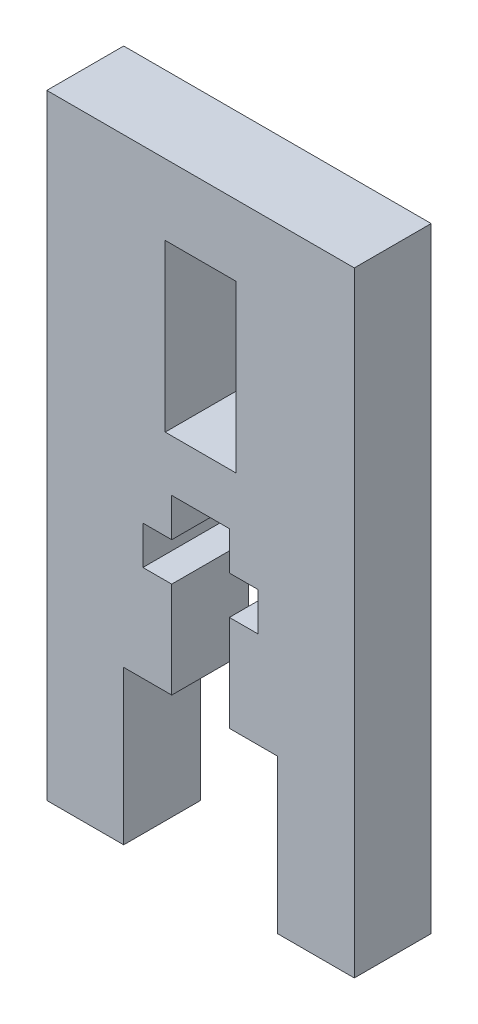
ISO-10303-21;
HEADER;
FILE_DESCRIPTION(('STEP AP214'),'2;1');
FILE_NAME('part.step','',(''),(''),'','','');
FILE_SCHEMA(('AUTOMOTIVE_DESIGN { 1 0 10303 214 1 1 1 1 }'));
ENDSEC;
DATA;
#1=APPLICATION_CONTEXT('core data for automotive mechanical design processes');
#2=APPLICATION_PROTOCOL_DEFINITION('international standard','automotive_design',2000,#1);
#3=PRODUCT_CONTEXT('',#1,'mechanical');
#4=PRODUCT('Part','Part','',(#3));
#5=PRODUCT_RELATED_PRODUCT_CATEGORY('part','',(#4));
#6=PRODUCT_DEFINITION_FORMATION('','',#4);
#7=PRODUCT_DEFINITION_CONTEXT('part definition',#1,'design');
#8=PRODUCT_DEFINITION('design','',#6,#7);
#9=PRODUCT_DEFINITION_SHAPE('','',#8);
#10=(LENGTH_UNIT() NAMED_UNIT(*) SI_UNIT(.MILLI.,.METRE.));
#11=(NAMED_UNIT(*) PLANE_ANGLE_UNIT() SI_UNIT($,.RADIAN.));
#12=(NAMED_UNIT(*) SI_UNIT($,.STERADIAN.) SOLID_ANGLE_UNIT());
#13=UNCERTAINTY_MEASURE_WITH_UNIT(LENGTH_MEASURE(1.E-05),#10,'distance_accuracy_value','');
#14=(GEOMETRIC_REPRESENTATION_CONTEXT(3) GLOBAL_UNCERTAINTY_ASSIGNED_CONTEXT((#13)) GLOBAL_UNIT_ASSIGNED_CONTEXT((#10,
#11,#12)) REPRESENTATION_CONTEXT('',''));
#15=CARTESIAN_POINT('',(0.,0.,0.));
#16=DIRECTION('',(0.,0.,1.));
#17=DIRECTION('',(1.,0.,0.));
#18=AXIS2_PLACEMENT_3D('',#15,#16,#17);
#19=CARTESIAN_POINT('',(-6.35,-12.7,6.35));
#20=DIRECTION('',(0.,1.,0.));
#21=DIRECTION('',(0.,0.,1.));
#22=AXIS2_PLACEMENT_3D('',#19,#20,#21);
#23=PLANE('',#22);
#24=DIRECTION('',(0.,0.,1.));
#25=VECTOR('',#24,1.);
#26=CARTESIAN_POINT('',(2.38125,-12.7,0.));
#27=LINE('',#26,#25);
#28=CARTESIAN_POINT('',(2.38125,-12.7,0.));
#29=VERTEX_POINT('',#28);
#30=CARTESIAN_POINT('',(2.38125,-12.7,6.35));
#31=VERTEX_POINT('',#30);
#32=EDGE_CURVE('E318',#29,#31,#27,.T.);
#33=ORIENTED_EDGE('',*,*,#32,.F.);
#34=DIRECTION('',(1.,0.,0.));
#35=VECTOR('',#34,1.);
#36=CARTESIAN_POINT('',(-6.35,-12.7,0.));
#37=LINE('',#36,#35);
#38=CARTESIAN_POINT('',(6.35,-12.7,0.));
#39=VERTEX_POINT('',#38);
#40=EDGE_CURVE('E361',#29,#39,#37,.T.);
#41=ORIENTED_EDGE('',*,*,#40,.T.);
#42=DIRECTION('',(0.,0.,-1.));
#43=VECTOR('',#42,1.);
#44=CARTESIAN_POINT('',(6.35,-12.7,6.35));
#45=LINE('',#44,#43);
#46=CARTESIAN_POINT('',(6.35,-12.7,6.35));
#47=VERTEX_POINT('',#46);
#48=EDGE_CURVE('E373',#47,#39,#45,.T.);
#49=ORIENTED_EDGE('',*,*,#48,.F.);
#50=DIRECTION('',(1.,0.,0.));
#51=VECTOR('',#50,1.);
#52=CARTESIAN_POINT('',(-6.35,-12.7,6.35));
#53=LINE('',#52,#51);
#54=EDGE_CURVE('E342',#31,#47,#53,.T.);
#55=ORIENTED_EDGE('',*,*,#54,.F.);
#56=EDGE_LOOP('',(#33,#41,#49,#55));
#57=FACE_BOUND('',#56,.T.);
#58=ADVANCED_FACE('F57',(#57),#23,.F.);
#59=CARTESIAN_POINT('',(0.,0.,6.35));
#60=DIRECTION('',(0.,0.,-1.));
#61=DIRECTION('',(-1.,0.,0.));
#62=AXIS2_PLACEMENT_3D('',#59,#60,#61);
#63=PLANE('',#62);
#64=DIRECTION('',(-1.,0.,0.));
#65=VECTOR('',#64,1.);
#66=CARTESIAN_POINT('',(-2.921,19.558,6.35));
#67=LINE('',#66,#65);
#68=CARTESIAN_POINT('',(2.921,19.558,6.35));
#69=VERTEX_POINT('',#68);
#70=CARTESIAN_POINT('',(-2.921,19.558,6.35));
#71=VERTEX_POINT('',#70);
#72=EDGE_CURVE('E245',#69,#71,#67,.T.);
#73=ORIENTED_EDGE('',*,*,#72,.F.);
#74=DIRECTION('',(0.,1.,0.));
#75=VECTOR('',#74,1.);
#76=CARTESIAN_POINT('',(2.921,19.558,6.35));
#77=LINE('',#76,#75);
#78=CARTESIAN_POINT('',(2.921,5.842,6.35));
#79=VERTEX_POINT('',#78);
#80=EDGE_CURVE('E72',#79,#69,#77,.T.);
#81=ORIENTED_EDGE('',*,*,#80,.F.);
#82=DIRECTION('',(1.,0.,0.));
#83=VECTOR('',#82,1.);
#84=CARTESIAN_POINT('',(-2.921,5.842,6.35));
#85=LINE('',#84,#83);
#86=CARTESIAN_POINT('',(-2.921,5.842,6.35));
#87=VERTEX_POINT('',#86);
#88=EDGE_CURVE('E236',#87,#79,#85,.T.);
#89=ORIENTED_EDGE('',*,*,#88,.F.);
#90=DIRECTION('',(0.,-1.,0.));
#91=VECTOR('',#90,1.);
#92=CARTESIAN_POINT('',(-2.921,19.558,6.35));
#93=LINE('',#92,#91);
#94=EDGE_CURVE('E239',#71,#87,#93,.T.);
#95=ORIENTED_EDGE('',*,*,#94,.F.);
#96=EDGE_LOOP('',(#73,#81,#89,#95));
#97=FACE_BOUND('',#96,.T.);
#98=DIRECTION('',(0.,-1.,0.));
#99=VECTOR('',#98,1.);
#100=CARTESIAN_POINT('',(2.38125,1.5875,6.35));
#101=LINE('',#100,#99);
#102=CARTESIAN_POINT('',(2.38125,-4.7625,6.35));
#103=VERTEX_POINT('',#102);
#104=EDGE_CURVE('E308',#103,#31,#101,.T.);
#105=ORIENTED_EDGE('',*,*,#104,.T.);
#106=ORIENTED_EDGE('',*,*,#54,.T.);
#107=DIRECTION('',(0.,-1.,0.));
#108=VECTOR('',#107,1.);
#109=CARTESIAN_POINT('',(6.35,-12.7,6.35));
#110=LINE('',#109,#108);
#111=CARTESIAN_POINT('',(6.35,-25.4,6.35));
#112=VERTEX_POINT('',#111);
#113=EDGE_CURVE('E346',#47,#112,#110,.T.);
#114=ORIENTED_EDGE('',*,*,#113,.T.);
#115=DIRECTION('',(1.,0.,0.));
#116=VECTOR('',#115,1.);
#117=CARTESIAN_POINT('',(6.35,-25.4,6.35));
#118=LINE('',#117,#116);
#119=CARTESIAN_POINT('',(12.7,-25.4,6.35));
#120=VERTEX_POINT('',#119);
#121=EDGE_CURVE('E348',#112,#120,#118,.T.);
#122=ORIENTED_EDGE('',*,*,#121,.T.);
#123=DIRECTION('',(0.,1.,0.));
#124=VECTOR('',#123,1.);
#125=CARTESIAN_POINT('',(12.7,-25.4,6.35));
#126=LINE('',#125,#124);
#127=CARTESIAN_POINT('',(12.7,25.4,6.35));
#128=VERTEX_POINT('',#127);
#129=EDGE_CURVE('E330',#120,#128,#126,.T.);
#130=ORIENTED_EDGE('',*,*,#129,.T.);
#131=DIRECTION('',(-1.,0.,0.));
#132=VECTOR('',#131,1.);
#133=CARTESIAN_POINT('',(-12.7,25.4,6.35));
#134=LINE('',#133,#132);
#135=CARTESIAN_POINT('',(-12.7,25.4,6.35));
#136=VERTEX_POINT('',#135);
#137=EDGE_CURVE('E333',#128,#136,#134,.T.);
#138=ORIENTED_EDGE('',*,*,#137,.T.);
#139=DIRECTION('',(0.,-1.,0.));
#140=VECTOR('',#139,1.);
#141=CARTESIAN_POINT('',(-12.7,-25.4,6.35));
#142=LINE('',#141,#140);
#143=CARTESIAN_POINT('',(-12.7,-25.4,6.35));
#144=VERTEX_POINT('',#143);
#145=EDGE_CURVE('E336',#136,#144,#142,.T.);
#146=ORIENTED_EDGE('',*,*,#145,.T.);
#147=DIRECTION('',(1.,0.,0.));
#148=VECTOR('',#147,1.);
#149=CARTESIAN_POINT('',(-12.7,-25.4,6.35));
#150=LINE('',#149,#148);
#151=CARTESIAN_POINT('',(-6.35,-25.4,6.35));
#152=VERTEX_POINT('',#151);
#153=EDGE_CURVE('E338',#144,#152,#150,.T.);
#154=ORIENTED_EDGE('',*,*,#153,.T.);
#155=DIRECTION('',(0.,1.,0.));
#156=VECTOR('',#155,1.);
#157=CARTESIAN_POINT('',(-6.35,-12.7,6.35));
#158=LINE('',#157,#156);
#159=CARTESIAN_POINT('',(-6.35,-12.7,6.35));
#160=VERTEX_POINT('',#159);
#161=EDGE_CURVE('E340',#152,#160,#158,.T.);
#162=ORIENTED_EDGE('',*,*,#161,.T.);
#163=CARTESIAN_POINT('',(-2.38125,-12.7,6.35));
#164=VERTEX_POINT('',#163);
#165=EDGE_CURVE('E343',#160,#164,#53,.T.);
#166=ORIENTED_EDGE('',*,*,#165,.T.);
#167=DIRECTION('',(0.,-1.,0.));
#168=VECTOR('',#167,1.);
#169=CARTESIAN_POINT('',(-2.38125,1.5875,6.35));
#170=LINE('',#169,#168);
#171=CARTESIAN_POINT('',(-2.38125,-4.7625,6.35));
#172=VERTEX_POINT('',#171);
#173=EDGE_CURVE('E251',#172,#164,#170,.T.);
#174=ORIENTED_EDGE('',*,*,#173,.F.);
#175=DIRECTION('',(-1.,0.,0.));
#176=VECTOR('',#175,1.);
#177=CARTESIAN_POINT('',(4.7625,-4.7625,6.35));
#178=LINE('',#177,#176);
#179=CARTESIAN_POINT('',(-4.7625,-4.7625,6.35));
#180=VERTEX_POINT('',#179);
#181=EDGE_CURVE('E273',#172,#180,#178,.T.);
#182=ORIENTED_EDGE('',*,*,#181,.T.);
#183=DIRECTION('',(0.,-1.,0.));
#184=VECTOR('',#183,1.);
#185=CARTESIAN_POINT('',(-4.7625,-1.5875,6.35));
#186=LINE('',#185,#184);
#187=CARTESIAN_POINT('',(-4.7625,-1.5875,6.35));
#188=VERTEX_POINT('',#187);
#189=EDGE_CURVE('E278',#188,#180,#186,.T.);
#190=ORIENTED_EDGE('',*,*,#189,.F.);
#191=DIRECTION('',(-1.,0.,0.));
#192=VECTOR('',#191,1.);
#193=CARTESIAN_POINT('',(4.7625,-1.5875,6.35));
#194=LINE('',#193,#192);
#195=CARTESIAN_POINT('',(-2.38125,-1.5875,6.35));
#196=VERTEX_POINT('',#195);
#197=EDGE_CURVE('E281',#196,#188,#194,.T.);
#198=ORIENTED_EDGE('',*,*,#197,.F.);
#199=CARTESIAN_POINT('',(-2.38125,1.5875,6.35));
#200=VERTEX_POINT('',#199);
#201=EDGE_CURVE('E305',#200,#196,#170,.T.);
#202=ORIENTED_EDGE('',*,*,#201,.F.);
#203=DIRECTION('',(1.,0.,0.));
#204=VECTOR('',#203,1.);
#205=CARTESIAN_POINT('',(-2.38125,1.5875,6.35));
#206=LINE('',#205,#204);
#207=CARTESIAN_POINT('',(2.38125,1.5875,6.35));
#208=VERTEX_POINT('',#207);
#209=EDGE_CURVE('E312',#200,#208,#206,.T.);
#210=ORIENTED_EDGE('',*,*,#209,.T.);
#211=CARTESIAN_POINT('',(2.38125,-1.5875,6.35));
#212=VERTEX_POINT('',#211);
#213=EDGE_CURVE('E309',#208,#212,#101,.T.);
#214=ORIENTED_EDGE('',*,*,#213,.T.);
#215=CARTESIAN_POINT('',(4.7625,-1.5875,6.35));
#216=VERTEX_POINT('',#215);
#217=EDGE_CURVE('E258',#216,#212,#194,.T.);
#218=ORIENTED_EDGE('',*,*,#217,.F.);
#219=DIRECTION('',(0.,-1.,0.));
#220=VECTOR('',#219,1.);
#221=CARTESIAN_POINT('',(4.7625,-1.5875,6.35));
#222=LINE('',#221,#220);
#223=CARTESIAN_POINT('',(4.7625,-4.7625,6.35));
#224=VERTEX_POINT('',#223);
#225=EDGE_CURVE('E270',#216,#224,#222,.T.);
#226=ORIENTED_EDGE('',*,*,#225,.T.);
#227=EDGE_CURVE('E275',#224,#103,#178,.T.);
#228=ORIENTED_EDGE('',*,*,#227,.T.);
#229=EDGE_LOOP('',(#105,#106,#114,#122,#130,#138,#146,#154,#162,#166,#174,#182,#190,#198,#202,
#210,#214,#218,#226,#228));
#230=FACE_BOUND('',#229,.T.);
#231=ADVANCED_FACE('F408',(#97,#230),#63,.F.);
#232=CARTESIAN_POINT('',(0.,0.,0.));
#233=DIRECTION('',(0.,0.,-1.));
#234=DIRECTION('',(-1.,0.,0.));
#235=AXIS2_PLACEMENT_3D('',#232,#233,#234);
#236=PLANE('',#235);
#237=DIRECTION('',(0.,1.,0.));
#238=VECTOR('',#237,1.);
#239=CARTESIAN_POINT('',(2.921,19.558,0.));
#240=LINE('',#239,#238);
#241=CARTESIAN_POINT('',(2.921,5.842,0.));
#242=VERTEX_POINT('',#241);
#243=CARTESIAN_POINT('',(2.921,19.558,0.));
#244=VERTEX_POINT('',#243);
#245=EDGE_CURVE('E220',#242,#244,#240,.T.);
#246=ORIENTED_EDGE('',*,*,#245,.T.);
#247=DIRECTION('',(-1.,0.,0.));
#248=VECTOR('',#247,1.);
#249=CARTESIAN_POINT('',(-2.921,19.558,0.));
#250=LINE('',#249,#248);
#251=CARTESIAN_POINT('',(-2.921,19.558,0.));
#252=VERTEX_POINT('',#251);
#253=EDGE_CURVE('E229',#244,#252,#250,.T.);
#254=ORIENTED_EDGE('',*,*,#253,.T.);
#255=DIRECTION('',(0.,-1.,0.));
#256=VECTOR('',#255,1.);
#257=CARTESIAN_POINT('',(-2.921,19.558,0.));
#258=LINE('',#257,#256);
#259=CARTESIAN_POINT('',(-2.921,5.842,0.));
#260=VERTEX_POINT('',#259);
#261=EDGE_CURVE('E80',#252,#260,#258,.T.);
#262=ORIENTED_EDGE('',*,*,#261,.T.);
#263=DIRECTION('',(1.,0.,0.));
#264=VECTOR('',#263,1.);
#265=CARTESIAN_POINT('',(-2.921,5.842,0.));
#266=LINE('',#265,#264);
#267=EDGE_CURVE('E226',#260,#242,#266,.T.);
#268=ORIENTED_EDGE('',*,*,#267,.T.);
#269=EDGE_LOOP('',(#246,#254,#262,#268));
#270=FACE_BOUND('',#269,.T.);
#271=ORIENTED_EDGE('',*,*,#40,.F.);
#272=DIRECTION('',(0.,-1.,0.));
#273=VECTOR('',#272,1.);
#274=CARTESIAN_POINT('',(2.38125,1.5875,0.));
#275=LINE('',#274,#273);
#276=CARTESIAN_POINT('',(2.38125,-4.7625,0.));
#277=VERTEX_POINT('',#276);
#278=EDGE_CURVE('E297',#277,#29,#275,.T.);
#279=ORIENTED_EDGE('',*,*,#278,.F.);
#280=DIRECTION('',(-1.,0.,0.));
#281=VECTOR('',#280,1.);
#282=CARTESIAN_POINT('',(4.7625,-4.7625,0.));
#283=LINE('',#282,#281);
#284=CARTESIAN_POINT('',(4.7625,-4.7625,0.));
#285=VERTEX_POINT('',#284);
#286=EDGE_CURVE('E259',#285,#277,#283,.T.);
#287=ORIENTED_EDGE('',*,*,#286,.F.);
#288=DIRECTION('',(0.,-1.,0.));
#289=VECTOR('',#288,1.);
#290=CARTESIAN_POINT('',(4.7625,-1.5875,0.));
#291=LINE('',#290,#289);
#292=CARTESIAN_POINT('',(4.7625,-1.5875,0.));
#293=VERTEX_POINT('',#292);
#294=EDGE_CURVE('E255',#293,#285,#291,.T.);
#295=ORIENTED_EDGE('',*,*,#294,.F.);
#296=DIRECTION('',(-1.,0.,0.));
#297=VECTOR('',#296,1.);
#298=CARTESIAN_POINT('',(4.7625,-1.5875,0.));
#299=LINE('',#298,#297);
#300=CARTESIAN_POINT('',(2.38125,-1.5875,0.));
#301=VERTEX_POINT('',#300);
#302=EDGE_CURVE('E266',#293,#301,#299,.T.);
#303=ORIENTED_EDGE('',*,*,#302,.T.);
#304=CARTESIAN_POINT('',(2.38125,1.5875,0.));
#305=VERTEX_POINT('',#304);
#306=EDGE_CURVE('E299',#305,#301,#275,.T.);
#307=ORIENTED_EDGE('',*,*,#306,.F.);
#308=DIRECTION('',(1.,0.,0.));
#309=VECTOR('',#308,1.);
#310=CARTESIAN_POINT('',(-2.38125,1.5875,0.));
#311=LINE('',#310,#309);
#312=CARTESIAN_POINT('',(-2.38125,1.5875,0.));
#313=VERTEX_POINT('',#312);
#314=EDGE_CURVE('E302',#313,#305,#311,.T.);
#315=ORIENTED_EDGE('',*,*,#314,.F.);
#316=DIRECTION('',(0.,-1.,0.));
#317=VECTOR('',#316,1.);
#318=CARTESIAN_POINT('',(-2.38125,1.5875,0.));
#319=LINE('',#318,#317);
#320=CARTESIAN_POINT('',(-2.38125,-1.5875,0.));
#321=VERTEX_POINT('',#320);
#322=EDGE_CURVE('E294',#313,#321,#319,.T.);
#323=ORIENTED_EDGE('',*,*,#322,.T.);
#324=CARTESIAN_POINT('',(-4.7625,-1.5875,0.));
#325=VERTEX_POINT('',#324);
#326=EDGE_CURVE('E265',#321,#325,#299,.T.);
#327=ORIENTED_EDGE('',*,*,#326,.T.);
#328=DIRECTION('',(0.,-1.,0.));
#329=VECTOR('',#328,1.);
#330=CARTESIAN_POINT('',(-4.7625,-1.5875,0.));
#331=LINE('',#330,#329);
#332=CARTESIAN_POINT('',(-4.7625,-4.7625,0.));
#333=VERTEX_POINT('',#332);
#334=EDGE_CURVE('E262',#325,#333,#331,.T.);
#335=ORIENTED_EDGE('',*,*,#334,.T.);
#336=CARTESIAN_POINT('',(-2.38125,-4.7625,0.));
#337=VERTEX_POINT('',#336);
#338=EDGE_CURVE('E257',#337,#333,#283,.T.);
#339=ORIENTED_EDGE('',*,*,#338,.F.);
#340=CARTESIAN_POINT('',(-2.38125,-12.7,0.));
#341=VERTEX_POINT('',#340);
#342=EDGE_CURVE('E298',#337,#341,#319,.T.);
#343=ORIENTED_EDGE('',*,*,#342,.T.);
#344=CARTESIAN_POINT('',(-6.35,-12.7,0.));
#345=VERTEX_POINT('',#344);
#346=EDGE_CURVE('E362',#345,#341,#37,.T.);
#347=ORIENTED_EDGE('',*,*,#346,.F.);
#348=DIRECTION('',(0.,1.,0.));
#349=VECTOR('',#348,1.);
#350=CARTESIAN_POINT('',(-6.35,-12.7,0.));
#351=LINE('',#350,#349);
#352=CARTESIAN_POINT('',(-6.35,-25.4,0.));
#353=VERTEX_POINT('',#352);
#354=EDGE_CURVE('E359',#353,#345,#351,.T.);
#355=ORIENTED_EDGE('',*,*,#354,.F.);
#356=DIRECTION('',(1.,0.,0.));
#357=VECTOR('',#356,1.);
#358=CARTESIAN_POINT('',(-12.7,-25.4,0.));
#359=LINE('',#358,#357);
#360=CARTESIAN_POINT('',(-12.7,-25.4,0.));
#361=VERTEX_POINT('',#360);
#362=EDGE_CURVE('E357',#361,#353,#359,.T.);
#363=ORIENTED_EDGE('',*,*,#362,.F.);
#364=DIRECTION('',(0.,-1.,0.));
#365=VECTOR('',#364,1.);
#366=CARTESIAN_POINT('',(-12.7,-25.4,0.));
#367=LINE('',#366,#365);
#368=CARTESIAN_POINT('',(-12.7,25.4,0.));
#369=VERTEX_POINT('',#368);
#370=EDGE_CURVE('E355',#369,#361,#367,.T.);
#371=ORIENTED_EDGE('',*,*,#370,.F.);
#372=DIRECTION('',(-1.,0.,0.));
#373=VECTOR('',#372,1.);
#374=CARTESIAN_POINT('',(-12.7,25.4,0.));
#375=LINE('',#374,#373);
#376=CARTESIAN_POINT('',(12.7,25.4,0.));
#377=VERTEX_POINT('',#376);
#378=EDGE_CURVE('E353',#377,#369,#375,.T.);
#379=ORIENTED_EDGE('',*,*,#378,.F.);
#380=DIRECTION('',(0.,1.,0.));
#381=VECTOR('',#380,1.);
#382=CARTESIAN_POINT('',(12.7,-25.4,0.));
#383=LINE('',#382,#381);
#384=CARTESIAN_POINT('',(12.7,-25.4,0.));
#385=VERTEX_POINT('',#384);
#386=EDGE_CURVE('E329',#385,#377,#383,.T.);
#387=ORIENTED_EDGE('',*,*,#386,.F.);
#388=DIRECTION('',(1.,0.,0.));
#389=VECTOR('',#388,1.);
#390=CARTESIAN_POINT('',(6.35,-25.4,0.));
#391=LINE('',#390,#389);
#392=CARTESIAN_POINT('',(6.35,-25.4,0.));
#393=VERTEX_POINT('',#392);
#394=EDGE_CURVE('E334',#393,#385,#391,.T.);
#395=ORIENTED_EDGE('',*,*,#394,.F.);
#396=DIRECTION('',(0.,-1.,0.));
#397=VECTOR('',#396,1.);
#398=CARTESIAN_POINT('',(6.35,-12.7,0.));
#399=LINE('',#398,#397);
#400=EDGE_CURVE('E365',#39,#393,#399,.T.);
#401=ORIENTED_EDGE('',*,*,#400,.F.);
#402=EDGE_LOOP('',(#271,#279,#287,#295,#303,#307,#315,#323,#327,#335,#339,#343,#347,#355,#363,
#371,#379,#387,#395,#401));
#403=FACE_BOUND('',#402,.T.);
#404=ADVANCED_FACE('F233',(#270,#403),#236,.T.);
#405=CARTESIAN_POINT('',(12.7,-25.4,6.35));
#406=DIRECTION('',(-1.,0.,0.));
#407=DIRECTION('',(0.,0.,1.));
#408=AXIS2_PLACEMENT_3D('',#405,#406,#407);
#409=PLANE('',#408);
#410=ORIENTED_EDGE('',*,*,#386,.T.);
#411=DIRECTION('',(0.,0.,-1.));
#412=VECTOR('',#411,1.);
#413=CARTESIAN_POINT('',(12.7,25.4,6.35));
#414=LINE('',#413,#412);
#415=EDGE_CURVE('E12',#128,#377,#414,.T.);
#416=ORIENTED_EDGE('',*,*,#415,.F.);
#417=ORIENTED_EDGE('',*,*,#129,.F.);
#418=DIRECTION('',(0.,0.,-1.));
#419=VECTOR('',#418,1.);
#420=CARTESIAN_POINT('',(12.7,-25.4,6.35));
#421=LINE('',#420,#419);
#422=EDGE_CURVE('E350',#120,#385,#421,.T.);
#423=ORIENTED_EDGE('',*,*,#422,.T.);
#424=EDGE_LOOP('',(#410,#416,#417,#423));
#425=FACE_BOUND('',#424,.T.);
#426=ADVANCED_FACE('F59',(#425),#409,.F.);
#427=CARTESIAN_POINT('',(-12.7,25.4,6.35));
#428=DIRECTION('',(0.,-1.,0.));
#429=DIRECTION('',(0.,0.,-1.));
#430=AXIS2_PLACEMENT_3D('',#427,#428,#429);
#431=PLANE('',#430);
#432=ORIENTED_EDGE('',*,*,#378,.T.);
#433=DIRECTION('',(0.,0.,-1.));
#434=VECTOR('',#433,1.);
#435=CARTESIAN_POINT('',(-12.7,25.4,6.35));
#436=LINE('',#435,#434);
#437=EDGE_CURVE('E65',#136,#369,#436,.T.);
#438=ORIENTED_EDGE('',*,*,#437,.F.);
#439=ORIENTED_EDGE('',*,*,#137,.F.);
#440=ORIENTED_EDGE('',*,*,#415,.T.);
#441=EDGE_LOOP('',(#432,#438,#439,#440));
#442=FACE_BOUND('',#441,.T.);
#443=ADVANCED_FACE('F412',(#442),#431,.F.);
#444=CARTESIAN_POINT('',(-12.7,-25.4,6.35));
#445=DIRECTION('',(1.,0.,0.));
#446=DIRECTION('',(0.,0.,-1.));
#447=AXIS2_PLACEMENT_3D('',#444,#445,#446);
#448=PLANE('',#447);
#449=ORIENTED_EDGE('',*,*,#370,.T.);
#450=DIRECTION('',(0.,0.,-1.));
#451=VECTOR('',#450,1.);
#452=CARTESIAN_POINT('',(-12.7,-25.4,6.35));
#453=LINE('',#452,#451);
#454=EDGE_CURVE('E382',#144,#361,#453,.T.);
#455=ORIENTED_EDGE('',*,*,#454,.F.);
#456=ORIENTED_EDGE('',*,*,#145,.F.);
#457=ORIENTED_EDGE('',*,*,#437,.T.);
#458=EDGE_LOOP('',(#449,#455,#456,#457));
#459=FACE_BOUND('',#458,.T.);
#460=ADVANCED_FACE('F389',(#459),#448,.F.);
#461=CARTESIAN_POINT('',(-12.7,-25.4,6.35));
#462=DIRECTION('',(0.,1.,0.));
#463=DIRECTION('',(0.,0.,1.));
#464=AXIS2_PLACEMENT_3D('',#461,#462,#463);
#465=PLANE('',#464);
#466=ORIENTED_EDGE('',*,*,#362,.T.);
#467=DIRECTION('',(0.,0.,-1.));
#468=VECTOR('',#467,1.);
#469=CARTESIAN_POINT('',(-6.35,-25.4,6.35));
#470=LINE('',#469,#468);
#471=EDGE_CURVE('E379',#152,#353,#470,.T.);
#472=ORIENTED_EDGE('',*,*,#471,.F.);
#473=ORIENTED_EDGE('',*,*,#153,.F.);
#474=ORIENTED_EDGE('',*,*,#454,.T.);
#475=EDGE_LOOP('',(#466,#472,#473,#474));
#476=FACE_BOUND('',#475,.T.);
#477=ADVANCED_FACE('F399',(#476),#465,.F.);
#478=CARTESIAN_POINT('',(-6.35,-12.7,6.35));
#479=DIRECTION('',(-1.,0.,0.));
#480=DIRECTION('',(0.,-1.,0.));
#481=AXIS2_PLACEMENT_3D('',#478,#479,#480);
#482=PLANE('',#481);
#483=ORIENTED_EDGE('',*,*,#354,.T.);
#484=DIRECTION('',(0.,0.,-1.));
#485=VECTOR('',#484,1.);
#486=CARTESIAN_POINT('',(-6.35,-12.7,6.35));
#487=LINE('',#486,#485);
#488=EDGE_CURVE('E376',#160,#345,#487,.T.);
#489=ORIENTED_EDGE('',*,*,#488,.F.);
#490=ORIENTED_EDGE('',*,*,#161,.F.);
#491=ORIENTED_EDGE('',*,*,#471,.T.);
#492=EDGE_LOOP('',(#483,#489,#490,#491));
#493=FACE_BOUND('',#492,.T.);
#494=ADVANCED_FACE('F403',(#493),#482,.F.);
#495=ORIENTED_EDGE('',*,*,#346,.T.);
#496=DIRECTION('',(0.,0.,1.));
#497=VECTOR('',#496,1.);
#498=CARTESIAN_POINT('',(-2.38125,-12.7,0.));
#499=LINE('',#498,#497);
#500=EDGE_CURVE('E304',#341,#164,#499,.T.);
#501=ORIENTED_EDGE('',*,*,#500,.T.);
#502=ORIENTED_EDGE('',*,*,#165,.F.);
#503=ORIENTED_EDGE('',*,*,#488,.T.);
#504=EDGE_LOOP('',(#495,#501,#502,#503));
#505=FACE_BOUND('',#504,.T.);
#506=ADVANCED_FACE('F476',(#505),#23,.F.);
#507=CARTESIAN_POINT('',(6.35,-12.7,6.35));
#508=DIRECTION('',(1.,0.,0.));
#509=DIRECTION('',(0.,1.,0.));
#510=AXIS2_PLACEMENT_3D('',#507,#508,#509);
#511=PLANE('',#510);
#512=ORIENTED_EDGE('',*,*,#400,.T.);
#513=DIRECTION('',(0.,0.,-1.));
#514=VECTOR('',#513,1.);
#515=CARTESIAN_POINT('',(6.35,-25.4,6.35));
#516=LINE('',#515,#514);
#517=EDGE_CURVE('E370',#112,#393,#516,.T.);
#518=ORIENTED_EDGE('',*,*,#517,.F.);
#519=ORIENTED_EDGE('',*,*,#113,.F.);
#520=ORIENTED_EDGE('',*,*,#48,.T.);
#521=EDGE_LOOP('',(#512,#518,#519,#520));
#522=FACE_BOUND('',#521,.T.);
#523=ADVANCED_FACE('F423',(#522),#511,.F.);
#524=CARTESIAN_POINT('',(6.35,-25.4,6.35));
#525=DIRECTION('',(0.,1.,0.));
#526=DIRECTION('',(0.,0.,1.));
#527=AXIS2_PLACEMENT_3D('',#524,#525,#526);
#528=PLANE('',#527);
#529=ORIENTED_EDGE('',*,*,#394,.T.);
#530=ORIENTED_EDGE('',*,*,#422,.F.);
#531=ORIENTED_EDGE('',*,*,#121,.F.);
#532=ORIENTED_EDGE('',*,*,#517,.T.);
#533=EDGE_LOOP('',(#529,#530,#531,#532));
#534=FACE_BOUND('',#533,.T.);
#535=ADVANCED_FACE('F418',(#534),#528,.F.);
#536=CARTESIAN_POINT('',(4.7625,-1.5875,0.));
#537=DIRECTION('',(0.,1.,0.));
#538=DIRECTION('',(-1.,0.,0.));
#539=AXIS2_PLACEMENT_3D('',#536,#537,#538);
#540=PLANE('',#539);
#541=ORIENTED_EDGE('',*,*,#302,.F.);
#542=DIRECTION('',(0.,0.,1.));
#543=VECTOR('',#542,1.);
#544=CARTESIAN_POINT('',(4.7625,-1.5875,0.));
#545=LINE('',#544,#543);
#546=EDGE_CURVE('E269',#293,#216,#545,.T.);
#547=ORIENTED_EDGE('',*,*,#546,.T.);
#548=ORIENTED_EDGE('',*,*,#217,.T.);
#549=DIRECTION('',(0.,0.,1.));
#550=VECTOR('',#549,1.);
#551=CARTESIAN_POINT('',(2.38125,-1.5875,0.));
#552=LINE('',#551,#550);
#553=EDGE_CURVE('E293',#301,#212,#552,.T.);
#554=ORIENTED_EDGE('',*,*,#553,.F.);
#555=EDGE_LOOP('',(#541,#547,#548,#554));
#556=FACE_BOUND('',#555,.T.);
#557=ADVANCED_FACE('F444',(#556),#540,.F.);
#558=CARTESIAN_POINT('',(4.7625,-1.5875,0.));
#559=DIRECTION('',(-1.,0.,0.));
#560=DIRECTION('',(0.,0.,1.));
#561=AXIS2_PLACEMENT_3D('',#558,#559,#560);
#562=PLANE('',#561);
#563=ORIENTED_EDGE('',*,*,#225,.F.);
#564=ORIENTED_EDGE('',*,*,#546,.F.);
#565=ORIENTED_EDGE('',*,*,#294,.T.);
#566=DIRECTION('',(0.,0.,1.));
#567=VECTOR('',#566,1.);
#568=CARTESIAN_POINT('',(4.7625,-4.7625,0.));
#569=LINE('',#568,#567);
#570=EDGE_CURVE('E290',#285,#224,#569,.T.);
#571=ORIENTED_EDGE('',*,*,#570,.T.);
#572=EDGE_LOOP('',(#563,#564,#565,#571));
#573=FACE_BOUND('',#572,.T.);
#574=ADVANCED_FACE('F439',(#573),#562,.T.);
#575=CARTESIAN_POINT('',(4.7625,-4.7625,0.));
#576=DIRECTION('',(0.,1.,0.));
#577=DIRECTION('',(-1.,0.,0.));
#578=AXIS2_PLACEMENT_3D('',#575,#576,#577);
#579=PLANE('',#578);
#580=DIRECTION('',(0.,0.,1.));
#581=VECTOR('',#580,1.);
#582=CARTESIAN_POINT('',(2.38125,-4.7625,0.));
#583=LINE('',#582,#581);
#584=EDGE_CURVE('E324',#277,#103,#583,.T.);
#585=ORIENTED_EDGE('',*,*,#584,.T.);
#586=ORIENTED_EDGE('',*,*,#227,.F.);
#587=ORIENTED_EDGE('',*,*,#570,.F.);
#588=ORIENTED_EDGE('',*,*,#286,.T.);
#589=EDGE_LOOP('',(#585,#586,#587,#588));
#590=FACE_BOUND('',#589,.T.);
#591=ADVANCED_FACE('F436',(#590),#579,.T.);
#592=CARTESIAN_POINT('',(-4.7625,-1.5875,0.));
#593=DIRECTION('',(-1.,0.,0.));
#594=DIRECTION('',(0.,0.,1.));
#595=AXIS2_PLACEMENT_3D('',#592,#593,#594);
#596=PLANE('',#595);
#597=ORIENTED_EDGE('',*,*,#189,.T.);
#598=DIRECTION('',(0.,0.,1.));
#599=VECTOR('',#598,1.);
#600=CARTESIAN_POINT('',(-4.7625,-4.7625,0.));
#601=LINE('',#600,#599);
#602=EDGE_CURVE('E288',#333,#180,#601,.T.);
#603=ORIENTED_EDGE('',*,*,#602,.F.);
#604=ORIENTED_EDGE('',*,*,#334,.F.);
#605=DIRECTION('',(0.,0.,1.));
#606=VECTOR('',#605,1.);
#607=CARTESIAN_POINT('',(-4.7625,-1.5875,0.));
#608=LINE('',#607,#606);
#609=EDGE_CURVE('E285',#325,#188,#608,.T.);
#610=ORIENTED_EDGE('',*,*,#609,.T.);
#611=EDGE_LOOP('',(#597,#603,#604,#610));
#612=FACE_BOUND('',#611,.T.);
#613=ADVANCED_FACE('F467',(#612),#596,.F.);
#614=DIRECTION('',(0.,0.,1.));
#615=VECTOR('',#614,1.);
#616=CARTESIAN_POINT('',(-2.38125,-1.5875,0.));
#617=LINE('',#616,#615);
#618=EDGE_CURVE('E323',#321,#196,#617,.T.);
#619=ORIENTED_EDGE('',*,*,#618,.T.);
#620=ORIENTED_EDGE('',*,*,#197,.T.);
#621=ORIENTED_EDGE('',*,*,#609,.F.);
#622=ORIENTED_EDGE('',*,*,#326,.F.);
#623=EDGE_LOOP('',(#619,#620,#621,#622));
#624=FACE_BOUND('',#623,.T.);
#625=ADVANCED_FACE('F462',(#624),#540,.F.);
#626=ORIENTED_EDGE('',*,*,#338,.T.);
#627=ORIENTED_EDGE('',*,*,#602,.T.);
#628=ORIENTED_EDGE('',*,*,#181,.F.);
#629=DIRECTION('',(0.,0.,1.));
#630=VECTOR('',#629,1.);
#631=CARTESIAN_POINT('',(-2.38125,-4.7625,0.));
#632=LINE('',#631,#630);
#633=EDGE_CURVE('E326',#337,#172,#632,.T.);
#634=ORIENTED_EDGE('',*,*,#633,.F.);
#635=EDGE_LOOP('',(#626,#627,#628,#634));
#636=FACE_BOUND('',#635,.T.);
#637=ADVANCED_FACE('F471',(#636),#579,.T.);
#638=CARTESIAN_POINT('',(-2.38125,1.5875,0.));
#639=DIRECTION('',(0.,-1.,0.));
#640=DIRECTION('',(0.,0.,-1.));
#641=AXIS2_PLACEMENT_3D('',#638,#639,#640);
#642=PLANE('',#641);
#643=ORIENTED_EDGE('',*,*,#209,.F.);
#644=DIRECTION('',(0.,0.,1.));
#645=VECTOR('',#644,1.);
#646=CARTESIAN_POINT('',(-2.38125,1.5875,0.));
#647=LINE('',#646,#645);
#648=EDGE_CURVE('E274',#313,#200,#647,.T.);
#649=ORIENTED_EDGE('',*,*,#648,.F.);
#650=ORIENTED_EDGE('',*,*,#314,.T.);
#651=DIRECTION('',(0.,0.,1.));
#652=VECTOR('',#651,1.);
#653=CARTESIAN_POINT('',(2.38125,1.5875,0.));
#654=LINE('',#653,#652);
#655=EDGE_CURVE('E316',#305,#208,#654,.T.);
#656=ORIENTED_EDGE('',*,*,#655,.T.);
#657=EDGE_LOOP('',(#643,#649,#650,#656));
#658=FACE_BOUND('',#657,.T.);
#659=ADVANCED_FACE('F452',(#658),#642,.T.);
#660=CARTESIAN_POINT('',(2.38125,1.5875,0.));
#661=DIRECTION('',(-1.,0.,0.));
#662=DIRECTION('',(0.,-1.,0.));
#663=AXIS2_PLACEMENT_3D('',#660,#661,#662);
#664=PLANE('',#663);
#665=ORIENTED_EDGE('',*,*,#553,.T.);
#666=ORIENTED_EDGE('',*,*,#213,.F.);
#667=ORIENTED_EDGE('',*,*,#655,.F.);
#668=ORIENTED_EDGE('',*,*,#306,.T.);
#669=EDGE_LOOP('',(#665,#666,#667,#668));
#670=FACE_BOUND('',#669,.T.);
#671=ADVANCED_FACE('F449',(#670),#664,.T.);
#672=CARTESIAN_POINT('',(-2.38125,1.5875,0.));
#673=DIRECTION('',(-1.,0.,0.));
#674=DIRECTION('',(0.,-1.,0.));
#675=AXIS2_PLACEMENT_3D('',#672,#673,#674);
#676=PLANE('',#675);
#677=ORIENTED_EDGE('',*,*,#322,.F.);
#678=ORIENTED_EDGE('',*,*,#648,.T.);
#679=ORIENTED_EDGE('',*,*,#201,.T.);
#680=ORIENTED_EDGE('',*,*,#618,.F.);
#681=EDGE_LOOP('',(#677,#678,#679,#680));
#682=FACE_BOUND('',#681,.T.);
#683=ADVANCED_FACE('F456',(#682),#676,.F.);
#684=ORIENTED_EDGE('',*,*,#278,.T.);
#685=ORIENTED_EDGE('',*,*,#32,.T.);
#686=ORIENTED_EDGE('',*,*,#104,.F.);
#687=ORIENTED_EDGE('',*,*,#584,.F.);
#688=EDGE_LOOP('',(#684,#685,#686,#687));
#689=FACE_BOUND('',#688,.T.);
#690=ADVANCED_FACE('F432',(#689),#664,.T.);
#691=ORIENTED_EDGE('',*,*,#633,.T.);
#692=ORIENTED_EDGE('',*,*,#173,.T.);
#693=ORIENTED_EDGE('',*,*,#500,.F.);
#694=ORIENTED_EDGE('',*,*,#342,.F.);
#695=EDGE_LOOP('',(#691,#692,#693,#694));
#696=FACE_BOUND('',#695,.T.);
#697=ADVANCED_FACE('F477',(#696),#676,.F.);
#698=CARTESIAN_POINT('',(2.921,19.558,0.));
#699=DIRECTION('',(1.,0.,0.));
#700=DIRECTION('',(0.,1.,0.));
#701=AXIS2_PLACEMENT_3D('',#698,#699,#700);
#702=PLANE('',#701);
#703=ORIENTED_EDGE('',*,*,#80,.T.);
#704=DIRECTION('',(0.,0.,1.));
#705=VECTOR('',#704,1.);
#706=CARTESIAN_POINT('',(2.921,19.558,0.));
#707=LINE('',#706,#705);
#708=EDGE_CURVE('E216',#244,#69,#707,.T.);
#709=ORIENTED_EDGE('',*,*,#708,.F.);
#710=ORIENTED_EDGE('',*,*,#245,.F.);
#711=DIRECTION('',(0.,0.,1.));
#712=VECTOR('',#711,1.);
#713=CARTESIAN_POINT('',(2.921,5.842,0.));
#714=LINE('',#713,#712);
#715=EDGE_CURVE('E249',#242,#79,#714,.T.);
#716=ORIENTED_EDGE('',*,*,#715,.T.);
#717=EDGE_LOOP('',(#703,#709,#710,#716));
#718=FACE_BOUND('',#717,.T.);
#719=ADVANCED_FACE('F218',(#718),#702,.F.);
#720=CARTESIAN_POINT('',(-2.921,5.842,0.));
#721=DIRECTION('',(0.,-1.,0.));
#722=DIRECTION('',(0.,0.,-1.));
#723=AXIS2_PLACEMENT_3D('',#720,#721,#722);
#724=PLANE('',#723);
#725=ORIENTED_EDGE('',*,*,#88,.T.);
#726=ORIENTED_EDGE('',*,*,#715,.F.);
#727=ORIENTED_EDGE('',*,*,#267,.F.);
#728=DIRECTION('',(0.,0.,1.));
#729=VECTOR('',#728,1.);
#730=CARTESIAN_POINT('',(-2.921,5.842,0.));
#731=LINE('',#730,#729);
#732=EDGE_CURVE('E252',#260,#87,#731,.T.);
#733=ORIENTED_EDGE('',*,*,#732,.T.);
#734=EDGE_LOOP('',(#725,#726,#727,#733));
#735=FACE_BOUND('',#734,.T.);
#736=ADVANCED_FACE('F484',(#735),#724,.F.);
#737=CARTESIAN_POINT('',(-2.921,19.558,0.));
#738=DIRECTION('',(-1.,0.,0.));
#739=DIRECTION('',(0.,-1.,0.));
#740=AXIS2_PLACEMENT_3D('',#737,#738,#739);
#741=PLANE('',#740);
#742=ORIENTED_EDGE('',*,*,#94,.T.);
#743=ORIENTED_EDGE('',*,*,#732,.F.);
#744=ORIENTED_EDGE('',*,*,#261,.F.);
#745=DIRECTION('',(0.,0.,1.));
#746=VECTOR('',#745,1.);
#747=CARTESIAN_POINT('',(-2.921,19.558,0.));
#748=LINE('',#747,#746);
#749=EDGE_CURVE('E225',#252,#71,#748,.T.);
#750=ORIENTED_EDGE('',*,*,#749,.T.);
#751=EDGE_LOOP('',(#742,#743,#744,#750));
#752=FACE_BOUND('',#751,.T.);
#753=ADVANCED_FACE('F584',(#752),#741,.F.);
#754=CARTESIAN_POINT('',(-2.921,19.558,0.));
#755=DIRECTION('',(0.,1.,0.));
#756=DIRECTION('',(0.,0.,1.));
#757=AXIS2_PLACEMENT_3D('',#754,#755,#756);
#758=PLANE('',#757);
#759=ORIENTED_EDGE('',*,*,#72,.T.);
#760=ORIENTED_EDGE('',*,*,#749,.F.);
#761=ORIENTED_EDGE('',*,*,#253,.F.);
#762=ORIENTED_EDGE('',*,*,#708,.T.);
#763=EDGE_LOOP('',(#759,#760,#761,#762));
#764=FACE_BOUND('',#763,.T.);
#765=ADVANCED_FACE('F230',(#764),#758,.F.);
#766=CLOSED_SHELL('',(#58,#231,#404,#426,#443,#460,#477,#494,#506,#523,#535,#557,#574,#591,#613,
#625,#637,#659,#671,#683,#690,#697,#719,#736,#753,#765));
#767=MANIFOLD_SOLID_BREP('B2',#766);
#768=ADVANCED_BREP_SHAPE_REPRESENTATION('',(#18,#767),#14);
#769=SHAPE_DEFINITION_REPRESENTATION(#9,#768);
ENDSEC;
END-ISO-10303-21;
